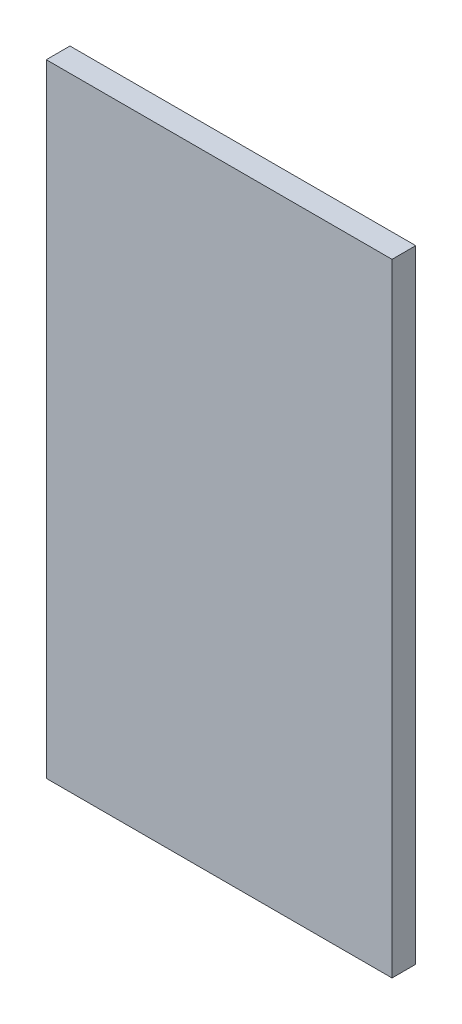
ISO-10303-21;
HEADER;
FILE_DESCRIPTION(('STEP AP214'),'2;1');
FILE_NAME('part.step','',(''),(''),'','','');
FILE_SCHEMA(('AUTOMOTIVE_DESIGN { 1 0 10303 214 1 1 1 1 }'));
ENDSEC;
DATA;
#1=APPLICATION_CONTEXT('core data for automotive mechanical design processes');
#2=APPLICATION_PROTOCOL_DEFINITION('international standard','automotive_design',2000,#1);
#3=PRODUCT_CONTEXT('',#1,'mechanical');
#4=PRODUCT('Part','Part','',(#3));
#5=PRODUCT_RELATED_PRODUCT_CATEGORY('part','',(#4));
#6=PRODUCT_DEFINITION_FORMATION('','',#4);
#7=PRODUCT_DEFINITION_CONTEXT('part definition',#1,'design');
#8=PRODUCT_DEFINITION('design','',#6,#7);
#9=PRODUCT_DEFINITION_SHAPE('','',#8);
#10=(LENGTH_UNIT() NAMED_UNIT(*) SI_UNIT(.MILLI.,.METRE.));
#11=(NAMED_UNIT(*) PLANE_ANGLE_UNIT() SI_UNIT($,.RADIAN.));
#12=(NAMED_UNIT(*) SI_UNIT($,.STERADIAN.) SOLID_ANGLE_UNIT());
#13=UNCERTAINTY_MEASURE_WITH_UNIT(LENGTH_MEASURE(1.E-05),#10,'distance_accuracy_value','');
#14=(GEOMETRIC_REPRESENTATION_CONTEXT(3) GLOBAL_UNCERTAINTY_ASSIGNED_CONTEXT((#13)) GLOBAL_UNIT_ASSIGNED_CONTEXT((#10,
#11,#12)) REPRESENTATION_CONTEXT('',''));
#15=CARTESIAN_POINT('',(0.,0.,0.));
#16=DIRECTION('',(0.,0.,1.));
#17=DIRECTION('',(1.,0.,0.));
#18=AXIS2_PLACEMENT_3D('',#15,#16,#17);
#19=CARTESIAN_POINT('',(7.40008,0.7,0.));
#20=DIRECTION('',(0.,0.,-1.));
#21=DIRECTION('',(-1.,0.,0.));
#22=AXIS2_PLACEMENT_3D('',#19,#20,#21);
#23=PLANE('',#22);
#24=DIRECTION('',(1.,0.,0.));
#25=VECTOR('',#24,1.);
#26=CARTESIAN_POINT('',(7.15008,1.15,0.));
#27=LINE('',#26,#25);
#28=CARTESIAN_POINT('',(7.15008,1.15,0.));
#29=VERTEX_POINT('',#28);
#30=CARTESIAN_POINT('',(7.65008,1.15,0.));
#31=VERTEX_POINT('',#30);
#32=EDGE_CURVE('E55',#29,#31,#27,.T.);
#33=ORIENTED_EDGE('',*,*,#32,.T.);
#34=DIRECTION('',(0.,1.,0.));
#35=VECTOR('',#34,1.);
#36=CARTESIAN_POINT('',(7.65008,1.15,0.));
#37=LINE('',#36,#35);
#38=CARTESIAN_POINT('',(7.65008,0.25,0.));
#39=VERTEX_POINT('',#38);
#40=EDGE_CURVE('E57',#31,#39,#37,.F.);
#41=ORIENTED_EDGE('',*,*,#40,.T.);
#42=DIRECTION('',(1.,0.,0.));
#43=VECTOR('',#42,1.);
#44=CARTESIAN_POINT('',(7.65008,0.25,0.));
#45=LINE('',#44,#43);
#46=CARTESIAN_POINT('',(7.15008,0.25,0.));
#47=VERTEX_POINT('',#46);
#48=EDGE_CURVE('E20',#39,#47,#45,.F.);
#49=ORIENTED_EDGE('',*,*,#48,.T.);
#50=DIRECTION('',(0.,1.,0.));
#51=VECTOR('',#50,1.);
#52=CARTESIAN_POINT('',(7.15008,0.25,0.));
#53=LINE('',#52,#51);
#54=EDGE_CURVE('E80',#47,#29,#53,.T.);
#55=ORIENTED_EDGE('',*,*,#54,.T.);
#56=EDGE_LOOP('',(#33,#41,#49,#55));
#57=FACE_BOUND('',#56,.T.);
#58=ADVANCED_FACE('F17',(#57),#23,.T.);
#59=CARTESIAN_POINT('',(7.65008,0.25,0.));
#60=DIRECTION('',(0.,1.,0.));
#61=DIRECTION('',(0.,0.,1.));
#62=AXIS2_PLACEMENT_3D('',#59,#60,#61);
#63=PLANE('',#62);
#64=DIRECTION('',(0.,0.,-1.));
#65=VECTOR('',#64,1.);
#66=CARTESIAN_POINT('',(7.15008,0.25,0.));
#67=LINE('',#66,#65);
#68=CARTESIAN_POINT('',(7.15008,0.25,0.03429));
#69=VERTEX_POINT('',#68);
#70=EDGE_CURVE('E68',#69,#47,#67,.T.);
#71=ORIENTED_EDGE('',*,*,#70,.T.);
#72=ORIENTED_EDGE('',*,*,#48,.F.);
#73=DIRECTION('',(0.,0.,1.));
#74=VECTOR('',#73,1.);
#75=CARTESIAN_POINT('',(7.65008,0.25,0.));
#76=LINE('',#75,#74);
#77=CARTESIAN_POINT('',(7.65008,0.25,0.03429));
#78=VERTEX_POINT('',#77);
#79=EDGE_CURVE('E63',#39,#78,#76,.T.);
#80=ORIENTED_EDGE('',*,*,#79,.T.);
#81=DIRECTION('',(1.,0.,0.));
#82=VECTOR('',#81,1.);
#83=CARTESIAN_POINT('',(7.40008,0.25,0.03429));
#84=LINE('',#83,#82);
#85=EDGE_CURVE('E83',#69,#78,#84,.T.);
#86=ORIENTED_EDGE('',*,*,#85,.F.);
#87=EDGE_LOOP('',(#71,#72,#80,#86));
#88=FACE_BOUND('',#87,.T.);
#89=ADVANCED_FACE('F65',(#88),#63,.F.);
#90=CARTESIAN_POINT('',(7.65008,1.15,0.));
#91=DIRECTION('',(-1.,0.,0.));
#92=DIRECTION('',(0.,0.,1.));
#93=AXIS2_PLACEMENT_3D('',#90,#91,#92);
#94=PLANE('',#93);
#95=ORIENTED_EDGE('',*,*,#79,.F.);
#96=ORIENTED_EDGE('',*,*,#40,.F.);
#97=DIRECTION('',(0.,0.,-1.));
#98=VECTOR('',#97,1.);
#99=CARTESIAN_POINT('',(7.65008,1.15,0.));
#100=LINE('',#99,#98);
#101=CARTESIAN_POINT('',(7.65008,1.15,0.03429));
#102=VERTEX_POINT('',#101);
#103=EDGE_CURVE('E75',#31,#102,#100,.F.);
#104=ORIENTED_EDGE('',*,*,#103,.T.);
#105=DIRECTION('',(0.,1.,0.));
#106=VECTOR('',#105,1.);
#107=CARTESIAN_POINT('',(7.65008,0.7,0.03429));
#108=LINE('',#107,#106);
#109=EDGE_CURVE('E72',#78,#102,#108,.T.);
#110=ORIENTED_EDGE('',*,*,#109,.F.);
#111=EDGE_LOOP('',(#95,#96,#104,#110));
#112=FACE_BOUND('',#111,.T.);
#113=ADVANCED_FACE('F70',(#112),#94,.F.);
#114=CARTESIAN_POINT('',(7.15008,1.15,0.));
#115=DIRECTION('',(0.,-1.,0.));
#116=DIRECTION('',(0.,0.,-1.));
#117=AXIS2_PLACEMENT_3D('',#114,#115,#116);
#118=PLANE('',#117);
#119=ORIENTED_EDGE('',*,*,#103,.F.);
#120=ORIENTED_EDGE('',*,*,#32,.F.);
#121=DIRECTION('',(0.,0.,-1.));
#122=VECTOR('',#121,1.);
#123=CARTESIAN_POINT('',(7.15008,1.15,0.));
#124=LINE('',#123,#122);
#125=CARTESIAN_POINT('',(7.15008,1.15,0.03429));
#126=VERTEX_POINT('',#125);
#127=EDGE_CURVE('E35',#29,#126,#124,.F.);
#128=ORIENTED_EDGE('',*,*,#127,.T.);
#129=DIRECTION('',(1.,0.,0.));
#130=VECTOR('',#129,1.);
#131=CARTESIAN_POINT('',(7.40008,1.15,0.03429));
#132=LINE('',#131,#130);
#133=EDGE_CURVE('E26',#102,#126,#132,.F.);
#134=ORIENTED_EDGE('',*,*,#133,.F.);
#135=EDGE_LOOP('',(#119,#120,#128,#134));
#136=FACE_BOUND('',#135,.T.);
#137=ADVANCED_FACE('F89',(#136),#118,.F.);
#138=CARTESIAN_POINT('',(7.15008,0.25,0.));
#139=DIRECTION('',(1.,0.,0.));
#140=DIRECTION('',(0.,0.,-1.));
#141=AXIS2_PLACEMENT_3D('',#138,#139,#140);
#142=PLANE('',#141);
#143=ORIENTED_EDGE('',*,*,#127,.F.);
#144=ORIENTED_EDGE('',*,*,#54,.F.);
#145=ORIENTED_EDGE('',*,*,#70,.F.);
#146=DIRECTION('',(0.,1.,0.));
#147=VECTOR('',#146,1.);
#148=CARTESIAN_POINT('',(7.15008,0.7,0.03429));
#149=LINE('',#148,#147);
#150=EDGE_CURVE('E11',#126,#69,#149,.F.);
#151=ORIENTED_EDGE('',*,*,#150,.F.);
#152=EDGE_LOOP('',(#143,#144,#145,#151));
#153=FACE_BOUND('',#152,.T.);
#154=ADVANCED_FACE('F91',(#153),#142,.F.);
#155=CARTESIAN_POINT('',(7.40008,0.7,0.03429));
#156=DIRECTION('',(0.,0.,1.));
#157=DIRECTION('',(1.,0.,0.));
#158=AXIS2_PLACEMENT_3D('',#155,#156,#157);
#159=PLANE('',#158);
#160=ORIENTED_EDGE('',*,*,#133,.T.);
#161=ORIENTED_EDGE('',*,*,#150,.T.);
#162=ORIENTED_EDGE('',*,*,#85,.T.);
#163=ORIENTED_EDGE('',*,*,#109,.T.);
#164=EDGE_LOOP('',(#160,#161,#162,#163));
#165=FACE_BOUND('',#164,.T.);
#166=ADVANCED_FACE('F88',(#165),#159,.T.);
#167=CLOSED_SHELL('',(#58,#89,#113,#137,#154,#166));
#168=MANIFOLD_SOLID_BREP('B1',#167);
#169=ADVANCED_BREP_SHAPE_REPRESENTATION('',(#18,#168),#14);
#170=SHAPE_DEFINITION_REPRESENTATION(#9,#169);
ENDSEC;
END-ISO-10303-21;
